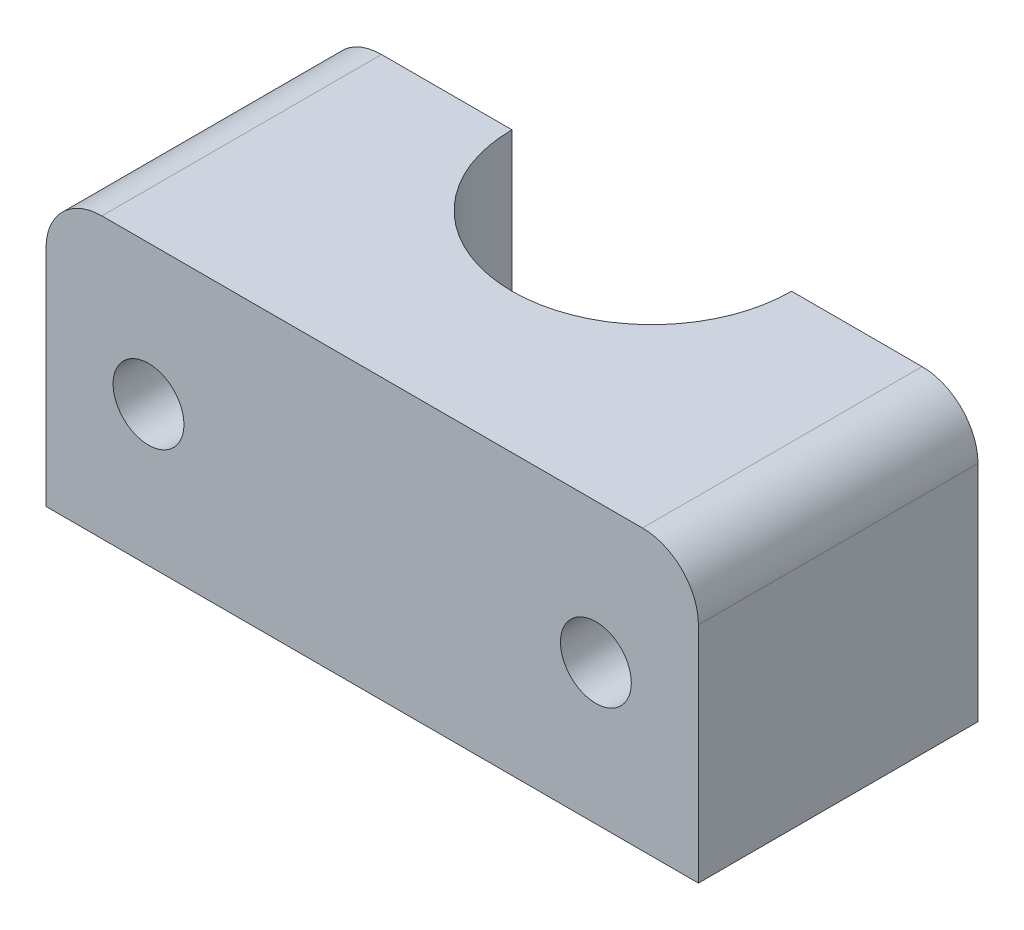
ISO-10303-21;
HEADER;
FILE_DESCRIPTION(('STEP AP214'),'2;1');
FILE_NAME('part.step','',(''),(''),'','','');
FILE_SCHEMA(('AUTOMOTIVE_DESIGN { 1 0 10303 214 1 1 1 1 }'));
ENDSEC;
DATA;
#1=APPLICATION_CONTEXT('core data for automotive mechanical design processes');
#2=APPLICATION_PROTOCOL_DEFINITION('international standard','automotive_design',2000,#1);
#3=PRODUCT_CONTEXT('',#1,'mechanical');
#4=PRODUCT('Part','Part','',(#3));
#5=PRODUCT_RELATED_PRODUCT_CATEGORY('part','',(#4));
#6=PRODUCT_DEFINITION_FORMATION('','',#4);
#7=PRODUCT_DEFINITION_CONTEXT('part definition',#1,'design');
#8=PRODUCT_DEFINITION('design','',#6,#7);
#9=PRODUCT_DEFINITION_SHAPE('','',#8);
#10=(LENGTH_UNIT() NAMED_UNIT(*) SI_UNIT(.MILLI.,.METRE.));
#11=(NAMED_UNIT(*) PLANE_ANGLE_UNIT() SI_UNIT($,.RADIAN.));
#12=(NAMED_UNIT(*) SI_UNIT($,.STERADIAN.) SOLID_ANGLE_UNIT());
#13=UNCERTAINTY_MEASURE_WITH_UNIT(LENGTH_MEASURE(1.E-05),#10,'distance_accuracy_value','');
#14=(GEOMETRIC_REPRESENTATION_CONTEXT(3) GLOBAL_UNCERTAINTY_ASSIGNED_CONTEXT((#13)) GLOBAL_UNIT_ASSIGNED_CONTEXT((#10,
#11,#12)) REPRESENTATION_CONTEXT('',''));
#15=CARTESIAN_POINT('',(0.,0.,0.));
#16=DIRECTION('',(0.,0.,1.));
#17=DIRECTION('',(1.,0.,0.));
#18=AXIS2_PLACEMENT_3D('',#15,#16,#17);
#19=CARTESIAN_POINT('',(0.,0.,0.));
#20=DIRECTION('',(0.,0.,1.));
#21=DIRECTION('',(1.,0.,0.));
#22=AXIS2_PLACEMENT_3D('',#19,#20,#21);
#23=PLANE('',#22);
#24=CARTESIAN_POINT('',(12.,0.,0.));
#25=DIRECTION('',(0.,0.,1.));
#26=DIRECTION('',(1.,0.,0.));
#27=AXIS2_PLACEMENT_3D('',#24,#25,#26);
#28=CIRCLE('',#27,1.9);
#29=CARTESIAN_POINT('',(13.9,0.,0.));
#30=VERTEX_POINT('',#29);
#31=EDGE_CURVE('E181',#30,#30,#28,.T.);
#32=ORIENTED_EDGE('',*,*,#31,.T.);
#33=EDGE_LOOP('',(#32));
#34=FACE_BOUND('',#33,.T.);
#35=DIRECTION('',(1.,0.,0.));
#36=VECTOR('',#35,1.);
#37=CARTESIAN_POINT('',(-17.5,-7.5,0.));
#38=LINE('',#37,#36);
#39=CARTESIAN_POINT('',(7.5,-7.5,0.));
#40=VERTEX_POINT('',#39);
#41=CARTESIAN_POINT('',(17.5,-7.5,0.));
#42=VERTEX_POINT('',#41);
#43=EDGE_CURVE('E171',#40,#42,#38,.T.);
#44=ORIENTED_EDGE('',*,*,#43,.F.);
#45=DIRECTION('',(0.,1.,0.));
#46=VECTOR('',#45,1.);
#47=CARTESIAN_POINT('',(7.5,-7.5,0.));
#48=LINE('',#47,#46);
#49=CARTESIAN_POINT('',(7.5,7.5,0.));
#50=VERTEX_POINT('',#49);
#51=EDGE_CURVE('E11',#40,#50,#48,.T.);
#52=ORIENTED_EDGE('',*,*,#51,.T.);
#53=DIRECTION('',(-1.,0.,0.));
#54=VECTOR('',#53,1.);
#55=CARTESIAN_POINT('',(-17.5,7.5,0.));
#56=LINE('',#55,#54);
#57=CARTESIAN_POINT('',(14.5,7.5,0.));
#58=VERTEX_POINT('',#57);
#59=EDGE_CURVE('E110',#58,#50,#56,.T.);
#60=ORIENTED_EDGE('',*,*,#59,.F.);
#61=CARTESIAN_POINT('',(14.5,4.5,0.));
#62=DIRECTION('',(0.,0.,1.));
#63=DIRECTION('',(1.,0.,0.));
#64=AXIS2_PLACEMENT_3D('',#61,#62,#63);
#65=CIRCLE('',#64,3.);
#66=CARTESIAN_POINT('',(17.5,4.5,0.));
#67=VERTEX_POINT('',#66);
#68=EDGE_CURVE('E133',#58,#67,#65,.F.);
#69=ORIENTED_EDGE('',*,*,#68,.T.);
#70=DIRECTION('',(0.,1.,0.));
#71=VECTOR('',#70,1.);
#72=CARTESIAN_POINT('',(17.5,7.5,0.));
#73=LINE('',#72,#71);
#74=EDGE_CURVE('E116',#42,#67,#73,.T.);
#75=ORIENTED_EDGE('',*,*,#74,.F.);
#76=EDGE_LOOP('',(#44,#52,#60,#69,#75));
#77=FACE_BOUND('',#76,.T.);
#78=ADVANCED_FACE('F32',(#34,#77),#23,.F.);
#79=CARTESIAN_POINT('',(-17.5,7.5,15.));
#80=DIRECTION('',(1.,0.,0.));
#81=DIRECTION('',(0.,0.,-1.));
#82=AXIS2_PLACEMENT_3D('',#79,#80,#81);
#83=PLANE('',#82);
#84=DIRECTION('',(0.,-1.,0.));
#85=VECTOR('',#84,1.);
#86=CARTESIAN_POINT('',(-17.5,7.5,15.));
#87=LINE('',#86,#85);
#88=CARTESIAN_POINT('',(-17.5,4.5,15.));
#89=VERTEX_POINT('',#88);
#90=CARTESIAN_POINT('',(-17.5,-7.5,15.));
#91=VERTEX_POINT('',#90);
#92=EDGE_CURVE('E118',#89,#91,#87,.T.);
#93=ORIENTED_EDGE('',*,*,#92,.F.);
#94=DIRECTION('',(0.,0.,-1.));
#95=VECTOR('',#94,1.);
#96=CARTESIAN_POINT('',(-17.5,4.5,15.));
#97=LINE('',#96,#95);
#98=CARTESIAN_POINT('',(-17.5,4.5,0.));
#99=VERTEX_POINT('',#98);
#100=EDGE_CURVE('E130',#89,#99,#97,.T.);
#101=ORIENTED_EDGE('',*,*,#100,.T.);
#102=DIRECTION('',(0.,-1.,0.));
#103=VECTOR('',#102,1.);
#104=CARTESIAN_POINT('',(-17.5,7.5,0.));
#105=LINE('',#104,#103);
#106=CARTESIAN_POINT('',(-17.5,-7.5,0.));
#107=VERTEX_POINT('',#106);
#108=EDGE_CURVE('E172',#99,#107,#105,.T.);
#109=ORIENTED_EDGE('',*,*,#108,.T.);
#110=DIRECTION('',(0.,0.,-1.));
#111=VECTOR('',#110,1.);
#112=CARTESIAN_POINT('',(-17.5,-7.5,15.));
#113=LINE('',#112,#111);
#114=EDGE_CURVE('E126',#91,#107,#113,.T.);
#115=ORIENTED_EDGE('',*,*,#114,.F.);
#116=EDGE_LOOP('',(#93,#101,#109,#115));
#117=FACE_BOUND('',#116,.T.);
#118=ADVANCED_FACE('F155',(#117),#83,.F.);
#119=CARTESIAN_POINT('',(-17.5,-7.5,15.));
#120=DIRECTION('',(0.,1.,0.));
#121=DIRECTION('',(-1.,0.,0.));
#122=AXIS2_PLACEMENT_3D('',#119,#120,#121);
#123=PLANE('',#122);
#124=CARTESIAN_POINT('',(-7.5,-7.5,0.));
#125=VERTEX_POINT('',#124);
#126=EDGE_CURVE('E119',#107,#125,#38,.T.);
#127=ORIENTED_EDGE('',*,*,#126,.T.);
#128=CARTESIAN_POINT('',(0.,-7.5,0.));
#129=DIRECTION('',(0.,1.,0.));
#130=DIRECTION('',(-1.,0.,0.));
#131=AXIS2_PLACEMENT_3D('',#128,#129,#130);
#132=CIRCLE('',#131,7.5);
#133=EDGE_CURVE('E47',#125,#40,#132,.T.);
#134=ORIENTED_EDGE('',*,*,#133,.T.);
#135=ORIENTED_EDGE('',*,*,#43,.T.);
#136=DIRECTION('',(0.,0.,-1.));
#137=VECTOR('',#136,1.);
#138=CARTESIAN_POINT('',(17.5,-7.5,15.));
#139=LINE('',#138,#137);
#140=CARTESIAN_POINT('',(17.5,-7.5,15.));
#141=VERTEX_POINT('',#140);
#142=EDGE_CURVE('E123',#141,#42,#139,.T.);
#143=ORIENTED_EDGE('',*,*,#142,.F.);
#144=DIRECTION('',(1.,0.,0.));
#145=VECTOR('',#144,1.);
#146=CARTESIAN_POINT('',(-17.5,-7.5,15.));
#147=LINE('',#146,#145);
#148=EDGE_CURVE('E156',#91,#141,#147,.T.);
#149=ORIENTED_EDGE('',*,*,#148,.F.);
#150=ORIENTED_EDGE('',*,*,#114,.T.);
#151=EDGE_LOOP('',(#127,#134,#135,#143,#149,#150));
#152=FACE_BOUND('',#151,.T.);
#153=ADVANCED_FACE('F170',(#152),#123,.F.);
#154=CARTESIAN_POINT('',(17.5,7.5,15.));
#155=DIRECTION('',(-1.,0.,0.));
#156=DIRECTION('',(0.,0.,1.));
#157=AXIS2_PLACEMENT_3D('',#154,#155,#156);
#158=PLANE('',#157);
#159=ORIENTED_EDGE('',*,*,#74,.T.);
#160=DIRECTION('',(0.,0.,-1.));
#161=VECTOR('',#160,1.);
#162=CARTESIAN_POINT('',(17.5,4.5,15.));
#163=LINE('',#162,#161);
#164=CARTESIAN_POINT('',(17.5,4.5,15.));
#165=VERTEX_POINT('',#164);
#166=EDGE_CURVE('E55',#67,#165,#163,.F.);
#167=ORIENTED_EDGE('',*,*,#166,.T.);
#168=DIRECTION('',(0.,1.,0.));
#169=VECTOR('',#168,1.);
#170=CARTESIAN_POINT('',(17.5,7.5,15.));
#171=LINE('',#170,#169);
#172=EDGE_CURVE('E160',#141,#165,#171,.T.);
#173=ORIENTED_EDGE('',*,*,#172,.F.);
#174=ORIENTED_EDGE('',*,*,#142,.T.);
#175=EDGE_LOOP('',(#159,#167,#173,#174));
#176=FACE_BOUND('',#175,.T.);
#177=ADVANCED_FACE('F167',(#176),#158,.F.);
#178=CARTESIAN_POINT('',(-17.5,7.5,15.));
#179=DIRECTION('',(0.,-1.,0.));
#180=DIRECTION('',(1.,0.,0.));
#181=AXIS2_PLACEMENT_3D('',#178,#179,#180);
#182=PLANE('',#181);
#183=ORIENTED_EDGE('',*,*,#59,.T.);
#184=CARTESIAN_POINT('',(0.,7.5,0.));
#185=DIRECTION('',(0.,1.,0.));
#186=DIRECTION('',(-1.,0.,0.));
#187=AXIS2_PLACEMENT_3D('',#184,#185,#186);
#188=CIRCLE('',#187,7.5);
#189=CARTESIAN_POINT('',(-7.5,7.5,0.));
#190=VERTEX_POINT('',#189);
#191=EDGE_CURVE('E98',#190,#50,#188,.T.);
#192=ORIENTED_EDGE('',*,*,#191,.F.);
#193=CARTESIAN_POINT('',(-14.5,7.5,0.));
#194=VERTEX_POINT('',#193);
#195=EDGE_CURVE('E106',#190,#194,#56,.T.);
#196=ORIENTED_EDGE('',*,*,#195,.T.);
#197=DIRECTION('',(0.,0.,-1.));
#198=VECTOR('',#197,1.);
#199=CARTESIAN_POINT('',(-14.5,7.5,15.));
#200=LINE('',#199,#198);
#201=CARTESIAN_POINT('',(-14.5,7.5,15.));
#202=VERTEX_POINT('',#201);
#203=EDGE_CURVE('E138',#194,#202,#200,.F.);
#204=ORIENTED_EDGE('',*,*,#203,.T.);
#205=DIRECTION('',(-1.,0.,0.));
#206=VECTOR('',#205,1.);
#207=CARTESIAN_POINT('',(-17.5,7.5,15.));
#208=LINE('',#207,#206);
#209=CARTESIAN_POINT('',(14.5,7.5,15.));
#210=VERTEX_POINT('',#209);
#211=EDGE_CURVE('E127',#210,#202,#208,.T.);
#212=ORIENTED_EDGE('',*,*,#211,.F.);
#213=DIRECTION('',(0.,0.,-1.));
#214=VECTOR('',#213,1.);
#215=CARTESIAN_POINT('',(14.5,7.5,15.));
#216=LINE('',#215,#214);
#217=EDGE_CURVE('E136',#210,#58,#216,.T.);
#218=ORIENTED_EDGE('',*,*,#217,.T.);
#219=EDGE_LOOP('',(#183,#192,#196,#204,#212,#218));
#220=FACE_BOUND('',#219,.T.);
#221=ADVANCED_FACE('F105',(#220),#182,.F.);
#222=CARTESIAN_POINT('',(0.,0.,15.));
#223=DIRECTION('',(0.,0.,1.));
#224=DIRECTION('',(1.,0.,0.));
#225=AXIS2_PLACEMENT_3D('',#222,#223,#224);
#226=PLANE('',#225);
#227=CARTESIAN_POINT('',(12.,0.,15.));
#228=DIRECTION('',(0.,0.,1.));
#229=DIRECTION('',(1.,0.,0.));
#230=AXIS2_PLACEMENT_3D('',#227,#228,#229);
#231=CIRCLE('',#230,1.9);
#232=CARTESIAN_POINT('',(13.9,0.,15.));
#233=VERTEX_POINT('',#232);
#234=EDGE_CURVE('E184',#233,#233,#231,.T.);
#235=ORIENTED_EDGE('',*,*,#234,.F.);
#236=EDGE_LOOP('',(#235));
#237=FACE_BOUND('',#236,.T.);
#238=CARTESIAN_POINT('',(-12.,0.,15.));
#239=DIRECTION('',(0.,0.,1.));
#240=DIRECTION('',(1.,0.,0.));
#241=AXIS2_PLACEMENT_3D('',#238,#239,#240);
#242=CIRCLE('',#241,1.9);
#243=CARTESIAN_POINT('',(-10.1,0.,15.));
#244=VERTEX_POINT('',#243);
#245=EDGE_CURVE('E178',#244,#244,#242,.T.);
#246=ORIENTED_EDGE('',*,*,#245,.F.);
#247=EDGE_LOOP('',(#246));
#248=FACE_BOUND('',#247,.T.);
#249=ORIENTED_EDGE('',*,*,#211,.T.);
#250=CARTESIAN_POINT('',(-14.5,4.5,15.));
#251=DIRECTION('',(0.,0.,1.));
#252=DIRECTION('',(1.,0.,0.));
#253=AXIS2_PLACEMENT_3D('',#250,#251,#252);
#254=CIRCLE('',#253,3.);
#255=EDGE_CURVE('E142',#202,#89,#254,.T.);
#256=ORIENTED_EDGE('',*,*,#255,.T.);
#257=ORIENTED_EDGE('',*,*,#92,.T.);
#258=ORIENTED_EDGE('',*,*,#148,.T.);
#259=ORIENTED_EDGE('',*,*,#172,.T.);
#260=CARTESIAN_POINT('',(14.5,4.5,15.));
#261=DIRECTION('',(0.,0.,1.));
#262=DIRECTION('',(1.,0.,0.));
#263=AXIS2_PLACEMENT_3D('',#260,#261,#262);
#264=CIRCLE('',#263,3.);
#265=EDGE_CURVE('E140',#165,#210,#264,.T.);
#266=ORIENTED_EDGE('',*,*,#265,.T.);
#267=EDGE_LOOP('',(#249,#256,#257,#258,#259,#266));
#268=FACE_BOUND('',#267,.T.);
#269=ADVANCED_FACE('F148',(#237,#248,#268),#226,.T.);
#270=CARTESIAN_POINT('',(-12.,0.,0.));
#271=DIRECTION('',(0.,0.,1.));
#272=DIRECTION('',(1.,0.,0.));
#273=AXIS2_PLACEMENT_3D('',#270,#271,#272);
#274=CIRCLE('',#273,1.9);
#275=CARTESIAN_POINT('',(-10.1,0.,0.));
#276=VERTEX_POINT('',#275);
#277=EDGE_CURVE('E173',#276,#276,#274,.T.);
#278=ORIENTED_EDGE('',*,*,#277,.T.);
#279=EDGE_LOOP('',(#278));
#280=FACE_BOUND('',#279,.T.);
#281=ORIENTED_EDGE('',*,*,#195,.F.);
#282=DIRECTION('',(0.,1.,0.));
#283=VECTOR('',#282,1.);
#284=CARTESIAN_POINT('',(-7.5,-7.5,0.));
#285=LINE('',#284,#283);
#286=EDGE_CURVE('E40',#190,#125,#285,.F.);
#287=ORIENTED_EDGE('',*,*,#286,.T.);
#288=ORIENTED_EDGE('',*,*,#126,.F.);
#289=ORIENTED_EDGE('',*,*,#108,.F.);
#290=CARTESIAN_POINT('',(-14.5,4.5,0.));
#291=DIRECTION('',(0.,0.,1.));
#292=DIRECTION('',(1.,0.,0.));
#293=AXIS2_PLACEMENT_3D('',#290,#291,#292);
#294=CIRCLE('',#293,3.);
#295=EDGE_CURVE('E114',#99,#194,#294,.F.);
#296=ORIENTED_EDGE('',*,*,#295,.T.);
#297=EDGE_LOOP('',(#281,#287,#288,#289,#296));
#298=FACE_BOUND('',#297,.T.);
#299=ADVANCED_FACE('F112',(#280,#298),#23,.F.);
#300=CARTESIAN_POINT('',(-12.,0.,0.));
#301=DIRECTION('',(0.,0.,1.));
#302=DIRECTION('',(1.,0.,0.));
#303=AXIS2_PLACEMENT_3D('',#300,#301,#302);
#304=CYLINDRICAL_SURFACE('',#303,1.9);
#305=ORIENTED_EDGE('',*,*,#277,.F.);
#306=EDGE_LOOP('',(#305));
#307=FACE_BOUND('',#306,.T.);
#308=ORIENTED_EDGE('',*,*,#245,.T.);
#309=EDGE_LOOP('',(#308));
#310=FACE_BOUND('',#309,.T.);
#311=ADVANCED_FACE('F195',(#307,#310),#304,.F.);
#312=CARTESIAN_POINT('',(12.,0.,0.));
#313=DIRECTION('',(0.,0.,1.));
#314=DIRECTION('',(1.,0.,0.));
#315=AXIS2_PLACEMENT_3D('',#312,#313,#314);
#316=CYLINDRICAL_SURFACE('',#315,1.9);
#317=ORIENTED_EDGE('',*,*,#31,.F.);
#318=EDGE_LOOP('',(#317));
#319=FACE_BOUND('',#318,.T.);
#320=ORIENTED_EDGE('',*,*,#234,.T.);
#321=EDGE_LOOP('',(#320));
#322=FACE_BOUND('',#321,.T.);
#323=ADVANCED_FACE('F192',(#319,#322),#316,.F.);
#324=CARTESIAN_POINT('',(-14.5,4.5,15.));
#325=DIRECTION('',(0.,0.,-1.));
#326=DIRECTION('',(-1.,0.,0.));
#327=AXIS2_PLACEMENT_3D('',#324,#325,#326);
#328=CYLINDRICAL_SURFACE('',#327,3.);
#329=ORIENTED_EDGE('',*,*,#255,.F.);
#330=ORIENTED_EDGE('',*,*,#203,.F.);
#331=ORIENTED_EDGE('',*,*,#295,.F.);
#332=ORIENTED_EDGE('',*,*,#100,.F.);
#333=EDGE_LOOP('',(#329,#330,#331,#332));
#334=FACE_BOUND('',#333,.T.);
#335=ADVANCED_FACE('F158',(#334),#328,.T.);
#336=CARTESIAN_POINT('',(14.5,4.5,15.));
#337=DIRECTION('',(0.,0.,-1.));
#338=DIRECTION('',(-1.,0.,0.));
#339=AXIS2_PLACEMENT_3D('',#336,#337,#338);
#340=CYLINDRICAL_SURFACE('',#339,3.);
#341=ORIENTED_EDGE('',*,*,#265,.F.);
#342=ORIENTED_EDGE('',*,*,#166,.F.);
#343=ORIENTED_EDGE('',*,*,#68,.F.);
#344=ORIENTED_EDGE('',*,*,#217,.F.);
#345=EDGE_LOOP('',(#341,#342,#343,#344));
#346=FACE_BOUND('',#345,.T.);
#347=ADVANCED_FACE('F34',(#346),#340,.T.);
#348=CARTESIAN_POINT('',(0.,-7.5,0.));
#349=DIRECTION('',(0.,1.,0.));
#350=DIRECTION('',(-1.,0.,0.));
#351=AXIS2_PLACEMENT_3D('',#348,#349,#350);
#352=CYLINDRICAL_SURFACE('',#351,7.5);
#353=ORIENTED_EDGE('',*,*,#133,.F.);
#354=ORIENTED_EDGE('',*,*,#286,.F.);
#355=ORIENTED_EDGE('',*,*,#191,.T.);
#356=ORIENTED_EDGE('',*,*,#51,.F.);
#357=EDGE_LOOP('',(#353,#354,#355,#356));
#358=FACE_BOUND('',#357,.T.);
#359=ADVANCED_FACE('F97',(#358),#352,.F.);
#360=CLOSED_SHELL('',(#78,#118,#153,#177,#221,#269,#299,#311,#323,#335,#347,#359));
#361=MANIFOLD_SOLID_BREP('B2',#360);
#362=ADVANCED_BREP_SHAPE_REPRESENTATION('',(#18,#361),#14);
#363=SHAPE_DEFINITION_REPRESENTATION(#9,#362);
ENDSEC;
END-ISO-10303-21;
